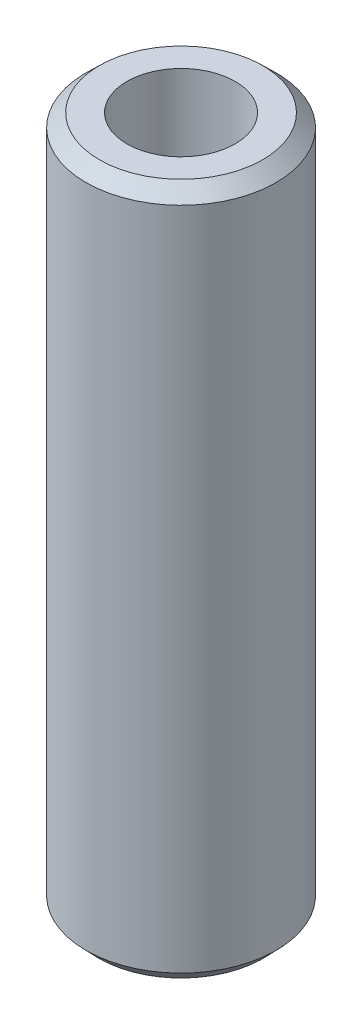
ISO-10303-21;
HEADER;
FILE_DESCRIPTION(('STEP AP214'),'2;1');
FILE_NAME('part.step','',(''),(''),'','','');
FILE_SCHEMA(('AUTOMOTIVE_DESIGN { 1 0 10303 214 1 1 1 1 }'));
ENDSEC;
DATA;
#1=APPLICATION_CONTEXT('core data for automotive mechanical design processes');
#2=APPLICATION_PROTOCOL_DEFINITION('international standard','automotive_design',2000,#1);
#3=PRODUCT_CONTEXT('',#1,'mechanical');
#4=PRODUCT('Part','Part','',(#3));
#5=PRODUCT_RELATED_PRODUCT_CATEGORY('part','',(#4));
#6=PRODUCT_DEFINITION_FORMATION('','',#4);
#7=PRODUCT_DEFINITION_CONTEXT('part definition',#1,'design');
#8=PRODUCT_DEFINITION('design','',#6,#7);
#9=PRODUCT_DEFINITION_SHAPE('','',#8);
#10=(LENGTH_UNIT() NAMED_UNIT(*) SI_UNIT(.MILLI.,.METRE.));
#11=(NAMED_UNIT(*) PLANE_ANGLE_UNIT() SI_UNIT($,.RADIAN.));
#12=(NAMED_UNIT(*) SI_UNIT($,.STERADIAN.) SOLID_ANGLE_UNIT());
#13=UNCERTAINTY_MEASURE_WITH_UNIT(LENGTH_MEASURE(1.E-05),#10,'distance_accuracy_value','');
#14=(GEOMETRIC_REPRESENTATION_CONTEXT(3) GLOBAL_UNCERTAINTY_ASSIGNED_CONTEXT((#13)) GLOBAL_UNIT_ASSIGNED_CONTEXT((#10,
#11,#12)) REPRESENTATION_CONTEXT('',''));
#15=CARTESIAN_POINT('',(0.,0.,0.));
#16=DIRECTION('',(0.,0.,1.));
#17=DIRECTION('',(1.,0.,0.));
#18=AXIS2_PLACEMENT_3D('',#15,#16,#17);
#19=CARTESIAN_POINT('',(0.,199.963210174725,0.));
#20=DIRECTION('',(0.,-1.,0.));
#21=DIRECTION('',(0.,0.,-1.));
#22=AXIS2_PLACEMENT_3D('',#19,#20,#21);
#23=CYLINDRICAL_SURFACE('',#22,27.5);
#24=CARTESIAN_POINT('',(0.,196.202011213574,0.));
#25=DIRECTION('',(0.,1.,0.));
#26=DIRECTION('',(0.,0.,1.));
#27=AXIS2_PLACEMENT_3D('',#24,#25,#26);
#28=CIRCLE('',#27,27.5);
#29=CARTESIAN_POINT('',(0.,196.202011213574,27.5));
#30=VERTEX_POINT('',#29);
#31=EDGE_CURVE('E50',#30,#30,#28,.F.);
#32=ORIENTED_EDGE('',*,*,#31,.T.);
#33=EDGE_LOOP('',(#32));
#34=FACE_BOUND('',#33,.T.);
#35=CARTESIAN_POINT('',(0.,3.8906192486714,0.));
#36=DIRECTION('',(0.,1.,0.));
#37=DIRECTION('',(0.,0.,1.));
#38=AXIS2_PLACEMENT_3D('',#35,#36,#37);
#39=CIRCLE('',#38,27.5);
#40=CARTESIAN_POINT('',(0.,3.8906192486714,27.5));
#41=VERTEX_POINT('',#40);
#42=EDGE_CURVE('E51',#41,#41,#39,.T.);
#43=ORIENTED_EDGE('',*,*,#42,.T.);
#44=EDGE_LOOP('',(#43));
#45=FACE_BOUND('',#44,.T.);
#46=ADVANCED_FACE('F39',(#34,#45),#23,.T.);
#47=CARTESIAN_POINT('',(0.,199.963210174725,0.));
#48=DIRECTION('',(0.,1.,0.));
#49=DIRECTION('',(0.,0.,1.));
#50=AXIS2_PLACEMENT_3D('',#47,#48,#49);
#51=PLANE('',#50);
#52=CARTESIAN_POINT('',(0.,199.963210174725,0.));
#53=DIRECTION('',(0.,1.,0.));
#54=DIRECTION('',(0.,0.,1.));
#55=AXIS2_PLACEMENT_3D('',#52,#53,#54);
#56=CIRCLE('',#55,23.6093807513285);
#57=CARTESIAN_POINT('',(0.,199.963210174725,23.6093807513285));
#58=VERTEX_POINT('',#57);
#59=EDGE_CURVE('E54',#58,#58,#56,.T.);
#60=ORIENTED_EDGE('',*,*,#59,.T.);
#61=EDGE_LOOP('',(#60));
#62=FACE_BOUND('',#61,.T.);
#63=CARTESIAN_POINT('',(0.,199.963210174725,0.));
#64=DIRECTION('',(0.,1.,0.));
#65=DIRECTION('',(0.,0.,1.));
#66=AXIS2_PLACEMENT_3D('',#63,#64,#65);
#67=CIRCLE('',#66,15.6557439810102);
#68=CARTESIAN_POINT('',(0.,199.963210174725,15.6557439810102));
#69=VERTEX_POINT('',#68);
#70=EDGE_CURVE('E58',#69,#69,#67,.T.);
#71=ORIENTED_EDGE('',*,*,#70,.F.);
#72=EDGE_LOOP('',(#71));
#73=FACE_BOUND('',#72,.T.);
#74=ADVANCED_FACE('F69',(#62,#73),#51,.T.);
#75=CARTESIAN_POINT('',(0.,0.,0.));
#76=DIRECTION('',(0.,1.,0.));
#77=DIRECTION('',(0.,0.,1.));
#78=AXIS2_PLACEMENT_3D('',#75,#76,#77);
#79=PLANE('',#78);
#80=CARTESIAN_POINT('',(0.,0.,0.));
#81=DIRECTION('',(0.,1.,0.));
#82=DIRECTION('',(0.,0.,1.));
#83=AXIS2_PLACEMENT_3D('',#80,#81,#82);
#84=CIRCLE('',#83,23.7388010388496);
#85=CARTESIAN_POINT('',(0.,0.,23.7388010388496));
#86=VERTEX_POINT('',#85);
#87=EDGE_CURVE('E10',#86,#86,#84,.F.);
#88=ORIENTED_EDGE('',*,*,#87,.T.);
#89=EDGE_LOOP('',(#88));
#90=FACE_BOUND('',#89,.T.);
#91=CARTESIAN_POINT('',(0.,0.,0.));
#92=DIRECTION('',(0.,1.,0.));
#93=DIRECTION('',(0.,0.,1.));
#94=AXIS2_PLACEMENT_3D('',#91,#92,#93);
#95=CIRCLE('',#94,15.6557439810102);
#96=CARTESIAN_POINT('',(0.,0.,15.6557439810102));
#97=VERTEX_POINT('',#96);
#98=EDGE_CURVE('E63',#97,#97,#95,.T.);
#99=ORIENTED_EDGE('',*,*,#98,.T.);
#100=EDGE_LOOP('',(#99));
#101=FACE_BOUND('',#100,.T.);
#102=ADVANCED_FACE('F75',(#90,#101),#79,.F.);
#103=CARTESIAN_POINT('',(0.,199.963210174725,0.));
#104=DIRECTION('',(0.,-1.,0.));
#105=DIRECTION('',(0.,0.,-1.));
#106=AXIS2_PLACEMENT_3D('',#103,#104,#105);
#107=CYLINDRICAL_SURFACE('',#106,15.6557439810102);
#108=ORIENTED_EDGE('',*,*,#70,.T.);
#109=EDGE_LOOP('',(#108));
#110=FACE_BOUND('',#109,.T.);
#111=ORIENTED_EDGE('',*,*,#98,.F.);
#112=EDGE_LOOP('',(#111));
#113=FACE_BOUND('',#112,.T.);
#114=ADVANCED_FACE('F70',(#110,#113),#107,.F.);
#115=CARTESIAN_POINT('',(0.,199.963210174725,0.));
#116=DIRECTION('',(0.,-1.,0.));
#117=DIRECTION('',(0.,0.,-1.));
#118=AXIS2_PLACEMENT_3D('',#115,#116,#117);
#119=CONICAL_SURFACE('',#118,23.6093807513285,0.802310215528658);
#120=ORIENTED_EDGE('',*,*,#31,.F.);
#121=EDGE_LOOP('',(#120));
#122=FACE_BOUND('',#121,.T.);
#123=ORIENTED_EDGE('',*,*,#59,.F.);
#124=EDGE_LOOP('',(#123));
#125=FACE_BOUND('',#124,.T.);
#126=ADVANCED_FACE('F81',(#122,#125),#119,.T.);
#127=CARTESIAN_POINT('',(0.,3.8906192486714,0.));
#128=DIRECTION('',(0.,1.,0.));
#129=DIRECTION('',(0.,0.,1.));
#130=AXIS2_PLACEMENT_3D('',#127,#128,#129);
#131=CONICAL_SURFACE('',#130,27.5,0.76848611126624);
#132=ORIENTED_EDGE('',*,*,#87,.F.);
#133=EDGE_LOOP('',(#132));
#134=FACE_BOUND('',#133,.T.);
#135=ORIENTED_EDGE('',*,*,#42,.F.);
#136=EDGE_LOOP('',(#135));
#137=FACE_BOUND('',#136,.T.);
#138=ADVANCED_FACE('F45',(#134,#137),#131,.T.);
#139=CLOSED_SHELL('',(#46,#74,#102,#114,#126,#138));
#140=MANIFOLD_SOLID_BREP('B2',#139);
#141=ADVANCED_BREP_SHAPE_REPRESENTATION('',(#18,#140),#14);
#142=SHAPE_DEFINITION_REPRESENTATION(#9,#141);
ENDSEC;
END-ISO-10303-21;
